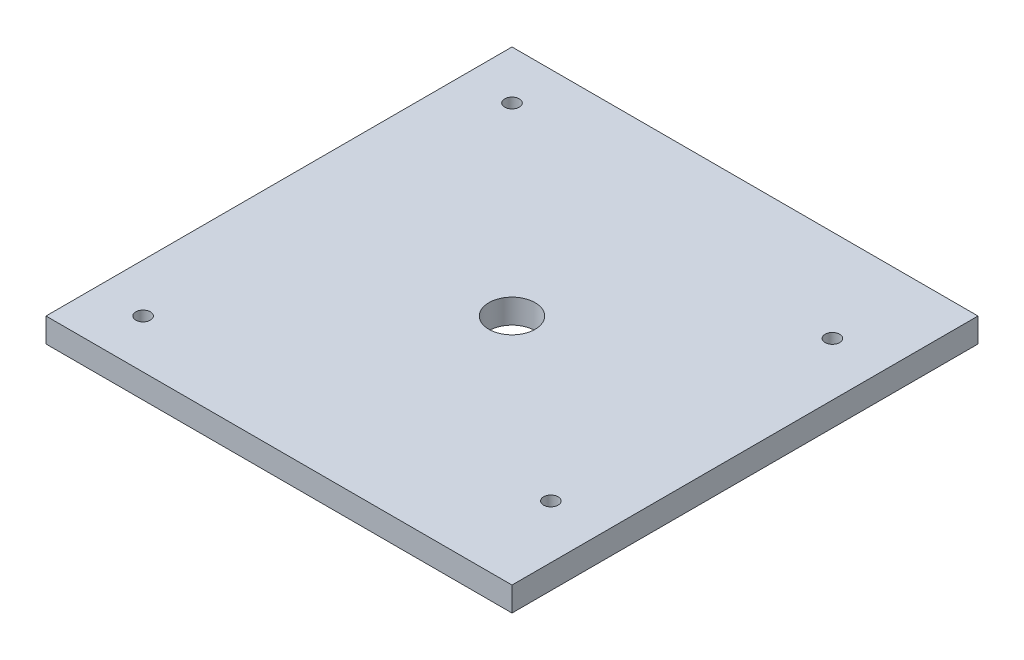
ISO-10303-21;
HEADER;
FILE_DESCRIPTION(('STEP AP214'),'2;1');
FILE_NAME('part.step','',(''),(''),'','','');
FILE_SCHEMA(('AUTOMOTIVE_DESIGN { 1 0 10303 214 1 1 1 1 }'));
ENDSEC;
DATA;
#1=APPLICATION_CONTEXT('core data for automotive mechanical design processes');
#2=APPLICATION_PROTOCOL_DEFINITION('international standard','automotive_design',2000,#1);
#3=PRODUCT_CONTEXT('',#1,'mechanical');
#4=PRODUCT('Part','Part','',(#3));
#5=PRODUCT_RELATED_PRODUCT_CATEGORY('part','',(#4));
#6=PRODUCT_DEFINITION_FORMATION('','',#4);
#7=PRODUCT_DEFINITION_CONTEXT('part definition',#1,'design');
#8=PRODUCT_DEFINITION('design','',#6,#7);
#9=PRODUCT_DEFINITION_SHAPE('','',#8);
#10=(LENGTH_UNIT() NAMED_UNIT(*) SI_UNIT(.MILLI.,.METRE.));
#11=(NAMED_UNIT(*) PLANE_ANGLE_UNIT() SI_UNIT($,.RADIAN.));
#12=(NAMED_UNIT(*) SI_UNIT($,.STERADIAN.) SOLID_ANGLE_UNIT());
#13=UNCERTAINTY_MEASURE_WITH_UNIT(LENGTH_MEASURE(1.E-05),#10,'distance_accuracy_value','');
#14=(GEOMETRIC_REPRESENTATION_CONTEXT(3) GLOBAL_UNCERTAINTY_ASSIGNED_CONTEXT((#13)) GLOBAL_UNIT_ASSIGNED_CONTEXT((#10,
#11,#12)) REPRESENTATION_CONTEXT('',''));
#15=CARTESIAN_POINT('',(0.,0.,0.));
#16=DIRECTION('',(0.,0.,1.));
#17=DIRECTION('',(1.,0.,0.));
#18=AXIS2_PLACEMENT_3D('',#15,#16,#17);
#19=CARTESIAN_POINT('',(0.,5.,0.));
#20=DIRECTION('',(0.,-1.,0.));
#21=DIRECTION('',(0.,0.,-1.));
#22=AXIS2_PLACEMENT_3D('',#19,#20,#21);
#23=PLANE('',#22);
#24=CARTESIAN_POINT('',(48.,5.,-48.));
#25=DIRECTION('',(0.,1.,0.));
#26=DIRECTION('',(0.,0.,1.));
#27=AXIS2_PLACEMENT_3D('',#24,#25,#26);
#28=CIRCLE('',#27,4.7625);
#29=CARTESIAN_POINT('',(48.,5.,-43.2375));
#30=VERTEX_POINT('',#29);
#31=EDGE_CURVE('E162',#30,#30,#28,.T.);
#32=ORIENTED_EDGE('',*,*,#31,.F.);
#33=EDGE_LOOP('',(#32));
#34=FACE_BOUND('',#33,.T.);
#35=DIRECTION('',(0.,0.,1.));
#36=VECTOR('',#35,1.);
#37=CARTESIAN_POINT('',(0.,5.,0.));
#38=LINE('',#37,#36);
#39=CARTESIAN_POINT('',(0.,5.,-96.));
#40=VERTEX_POINT('',#39);
#41=CARTESIAN_POINT('',(0.,5.,0.));
#42=VERTEX_POINT('',#41);
#43=EDGE_CURVE('E92',#40,#42,#38,.T.);
#44=ORIENTED_EDGE('',*,*,#43,.T.);
#45=DIRECTION('',(1.,0.,0.));
#46=VECTOR('',#45,1.);
#47=CARTESIAN_POINT('',(0.,5.,0.));
#48=LINE('',#47,#46);
#49=CARTESIAN_POINT('',(96.,5.,0.));
#50=VERTEX_POINT('',#49);
#51=EDGE_CURVE('E87',#42,#50,#48,.T.);
#52=ORIENTED_EDGE('',*,*,#51,.T.);
#53=DIRECTION('',(0.,0.,-1.));
#54=VECTOR('',#53,1.);
#55=CARTESIAN_POINT('',(96.,5.,0.));
#56=LINE('',#55,#54);
#57=CARTESIAN_POINT('',(96.,5.,-96.));
#58=VERTEX_POINT('',#57);
#59=EDGE_CURVE('E90',#50,#58,#56,.T.);
#60=ORIENTED_EDGE('',*,*,#59,.T.);
#61=DIRECTION('',(-1.,0.,0.));
#62=VECTOR('',#61,1.);
#63=CARTESIAN_POINT('',(0.,5.,-96.));
#64=LINE('',#63,#62);
#65=EDGE_CURVE('E57',#58,#40,#64,.T.);
#66=ORIENTED_EDGE('',*,*,#65,.T.);
#67=EDGE_LOOP('',(#44,#52,#60,#66));
#68=FACE_BOUND('',#67,.T.);
#69=CARTESIAN_POINT('',(10.,5.,-10.));
#70=DIRECTION('',(0.,1.,0.));
#71=DIRECTION('',(0.,0.,1.));
#72=AXIS2_PLACEMENT_3D('',#69,#70,#71);
#73=CIRCLE('',#72,1.5);
#74=CARTESIAN_POINT('',(10.,5.,-8.5));
#75=VERTEX_POINT('',#74);
#76=EDGE_CURVE('E112',#75,#75,#73,.T.);
#77=ORIENTED_EDGE('',*,*,#76,.F.);
#78=EDGE_LOOP('',(#77));
#79=FACE_BOUND('',#78,.T.);
#80=CARTESIAN_POINT('',(85.,5.,-19.));
#81=DIRECTION('',(0.,1.,0.));
#82=DIRECTION('',(0.,0.,1.));
#83=AXIS2_PLACEMENT_3D('',#80,#81,#82);
#84=CIRCLE('',#83,1.5);
#85=CARTESIAN_POINT('',(85.,5.,-17.5));
#86=VERTEX_POINT('',#85);
#87=EDGE_CURVE('E134',#86,#86,#84,.T.);
#88=ORIENTED_EDGE('',*,*,#87,.F.);
#89=EDGE_LOOP('',(#88));
#90=FACE_BOUND('',#89,.T.);
#91=CARTESIAN_POINT('',(85.,5.,-77.));
#92=DIRECTION('',(0.,1.,0.));
#93=DIRECTION('',(0.,0.,-1.));
#94=AXIS2_PLACEMENT_3D('',#91,#92,#93);
#95=CIRCLE('',#94,1.5);
#96=CARTESIAN_POINT('',(85.,5.,-78.5));
#97=VERTEX_POINT('',#96);
#98=EDGE_CURVE('E142',#97,#97,#95,.T.);
#99=ORIENTED_EDGE('',*,*,#98,.F.);
#100=EDGE_LOOP('',(#99));
#101=FACE_BOUND('',#100,.T.);
#102=CARTESIAN_POINT('',(10.,5.,-86.));
#103=DIRECTION('',(0.,1.,0.));
#104=DIRECTION('',(0.,0.,-1.));
#105=AXIS2_PLACEMENT_3D('',#102,#103,#104);
#106=CIRCLE('',#105,1.5);
#107=CARTESIAN_POINT('',(10.,5.,-87.5));
#108=VERTEX_POINT('',#107);
#109=EDGE_CURVE('E150',#108,#108,#106,.T.);
#110=ORIENTED_EDGE('',*,*,#109,.F.);
#111=EDGE_LOOP('',(#110));
#112=FACE_BOUND('',#111,.T.);
#113=ADVANCED_FACE('F39',(#34,#68,#79,#90,#101,#112),#23,.F.);
#114=CARTESIAN_POINT('',(0.,0.,0.));
#115=DIRECTION('',(0.,-1.,0.));
#116=DIRECTION('',(0.,0.,-1.));
#117=AXIS2_PLACEMENT_3D('',#114,#115,#116);
#118=PLANE('',#117);
#119=CARTESIAN_POINT('',(48.,0.,-48.));
#120=DIRECTION('',(0.,1.,0.));
#121=DIRECTION('',(0.,0.,1.));
#122=AXIS2_PLACEMENT_3D('',#119,#120,#121);
#123=CIRCLE('',#122,4.7625);
#124=CARTESIAN_POINT('',(48.,0.,-43.2375));
#125=VERTEX_POINT('',#124);
#126=EDGE_CURVE('E158',#125,#125,#123,.T.);
#127=ORIENTED_EDGE('',*,*,#126,.T.);
#128=EDGE_LOOP('',(#127));
#129=FACE_BOUND('',#128,.T.);
#130=CARTESIAN_POINT('',(85.,0.,-77.));
#131=DIRECTION('',(0.,1.,0.));
#132=DIRECTION('',(0.,0.,-1.));
#133=AXIS2_PLACEMENT_3D('',#130,#131,#132);
#134=CIRCLE('',#133,1.5);
#135=CARTESIAN_POINT('',(85.,0.,-78.5));
#136=VERTEX_POINT('',#135);
#137=EDGE_CURVE('E146',#136,#136,#134,.T.);
#138=ORIENTED_EDGE('',*,*,#137,.T.);
#139=EDGE_LOOP('',(#138));
#140=FACE_BOUND('',#139,.T.);
#141=CARTESIAN_POINT('',(10.,0.,-10.));
#142=DIRECTION('',(0.,1.,0.));
#143=DIRECTION('',(0.,0.,1.));
#144=AXIS2_PLACEMENT_3D('',#141,#142,#143);
#145=CIRCLE('',#144,1.5);
#146=CARTESIAN_POINT('',(10.,0.,-8.5));
#147=VERTEX_POINT('',#146);
#148=EDGE_CURVE('E130',#147,#147,#145,.T.);
#149=ORIENTED_EDGE('',*,*,#148,.T.);
#150=EDGE_LOOP('',(#149));
#151=FACE_BOUND('',#150,.T.);
#152=DIRECTION('',(0.,0.,1.));
#153=VECTOR('',#152,1.);
#154=CARTESIAN_POINT('',(0.,0.,0.));
#155=LINE('',#154,#153);
#156=CARTESIAN_POINT('',(0.,0.,-96.));
#157=VERTEX_POINT('',#156);
#158=CARTESIAN_POINT('',(0.,0.,0.));
#159=VERTEX_POINT('',#158);
#160=EDGE_CURVE('E108',#157,#159,#155,.T.);
#161=ORIENTED_EDGE('',*,*,#160,.F.);
#162=DIRECTION('',(-1.,0.,0.));
#163=VECTOR('',#162,1.);
#164=CARTESIAN_POINT('',(0.,0.,-96.));
#165=LINE('',#164,#163);
#166=CARTESIAN_POINT('',(96.,0.,-96.));
#167=VERTEX_POINT('',#166);
#168=EDGE_CURVE('E80',#167,#157,#165,.T.);
#169=ORIENTED_EDGE('',*,*,#168,.F.);
#170=DIRECTION('',(0.,0.,-1.));
#171=VECTOR('',#170,1.);
#172=CARTESIAN_POINT('',(96.,0.,0.));
#173=LINE('',#172,#171);
#174=CARTESIAN_POINT('',(96.,0.,0.));
#175=VERTEX_POINT('',#174);
#176=EDGE_CURVE('E74',#175,#167,#173,.T.);
#177=ORIENTED_EDGE('',*,*,#176,.F.);
#178=DIRECTION('',(1.,0.,0.));
#179=VECTOR('',#178,1.);
#180=CARTESIAN_POINT('',(0.,0.,0.));
#181=LINE('',#180,#179);
#182=EDGE_CURVE('E97',#159,#175,#181,.T.);
#183=ORIENTED_EDGE('',*,*,#182,.F.);
#184=EDGE_LOOP('',(#161,#169,#177,#183));
#185=FACE_BOUND('',#184,.T.);
#186=CARTESIAN_POINT('',(85.,0.,-19.));
#187=DIRECTION('',(0.,1.,0.));
#188=DIRECTION('',(0.,0.,1.));
#189=AXIS2_PLACEMENT_3D('',#186,#187,#188);
#190=CIRCLE('',#189,1.5);
#191=CARTESIAN_POINT('',(85.,0.,-17.5));
#192=VERTEX_POINT('',#191);
#193=EDGE_CURVE('E138',#192,#192,#190,.T.);
#194=ORIENTED_EDGE('',*,*,#193,.T.);
#195=EDGE_LOOP('',(#194));
#196=FACE_BOUND('',#195,.T.);
#197=CARTESIAN_POINT('',(10.,0.,-86.));
#198=DIRECTION('',(0.,1.,0.));
#199=DIRECTION('',(0.,0.,-1.));
#200=AXIS2_PLACEMENT_3D('',#197,#198,#199);
#201=CIRCLE('',#200,1.5);
#202=CARTESIAN_POINT('',(10.,0.,-87.5));
#203=VERTEX_POINT('',#202);
#204=EDGE_CURVE('E154',#203,#203,#201,.T.);
#205=ORIENTED_EDGE('',*,*,#204,.T.);
#206=EDGE_LOOP('',(#205));
#207=FACE_BOUND('',#206,.T.);
#208=ADVANCED_FACE('F125',(#129,#140,#151,#185,#196,#207),#118,.T.);
#209=CARTESIAN_POINT('',(0.,5.,0.));
#210=DIRECTION('',(1.,0.,0.));
#211=DIRECTION('',(0.,0.,-1.));
#212=AXIS2_PLACEMENT_3D('',#209,#210,#211);
#213=PLANE('',#212);
#214=ORIENTED_EDGE('',*,*,#160,.T.);
#215=DIRECTION('',(0.,-1.,0.));
#216=VECTOR('',#215,1.);
#217=CARTESIAN_POINT('',(0.,5.,0.));
#218=LINE('',#217,#216);
#219=EDGE_CURVE('E11',#42,#159,#218,.T.);
#220=ORIENTED_EDGE('',*,*,#219,.F.);
#221=ORIENTED_EDGE('',*,*,#43,.F.);
#222=DIRECTION('',(0.,-1.,0.));
#223=VECTOR('',#222,1.);
#224=CARTESIAN_POINT('',(0.,5.,-96.));
#225=LINE('',#224,#223);
#226=EDGE_CURVE('E104',#40,#157,#225,.T.);
#227=ORIENTED_EDGE('',*,*,#226,.T.);
#228=EDGE_LOOP('',(#214,#220,#221,#227));
#229=FACE_BOUND('',#228,.T.);
#230=ADVANCED_FACE('F41',(#229),#213,.F.);
#231=CARTESIAN_POINT('',(0.,5.,0.));
#232=DIRECTION('',(0.,0.,-1.));
#233=DIRECTION('',(-1.,0.,0.));
#234=AXIS2_PLACEMENT_3D('',#231,#232,#233);
#235=PLANE('',#234);
#236=ORIENTED_EDGE('',*,*,#182,.T.);
#237=DIRECTION('',(0.,-1.,0.));
#238=VECTOR('',#237,1.);
#239=CARTESIAN_POINT('',(96.,5.,0.));
#240=LINE('',#239,#238);
#241=EDGE_CURVE('E49',#50,#175,#240,.T.);
#242=ORIENTED_EDGE('',*,*,#241,.F.);
#243=ORIENTED_EDGE('',*,*,#51,.F.);
#244=ORIENTED_EDGE('',*,*,#219,.T.);
#245=EDGE_LOOP('',(#236,#242,#243,#244));
#246=FACE_BOUND('',#245,.T.);
#247=ADVANCED_FACE('F96',(#246),#235,.F.);
#248=CARTESIAN_POINT('',(96.,5.,0.));
#249=DIRECTION('',(-1.,0.,0.));
#250=DIRECTION('',(0.,0.,1.));
#251=AXIS2_PLACEMENT_3D('',#248,#249,#250);
#252=PLANE('',#251);
#253=ORIENTED_EDGE('',*,*,#176,.T.);
#254=DIRECTION('',(0.,-1.,0.));
#255=VECTOR('',#254,1.);
#256=CARTESIAN_POINT('',(96.,5.,-96.));
#257=LINE('',#256,#255);
#258=EDGE_CURVE('E99',#58,#167,#257,.T.);
#259=ORIENTED_EDGE('',*,*,#258,.F.);
#260=ORIENTED_EDGE('',*,*,#59,.F.);
#261=ORIENTED_EDGE('',*,*,#241,.T.);
#262=EDGE_LOOP('',(#253,#259,#260,#261));
#263=FACE_BOUND('',#262,.T.);
#264=ADVANCED_FACE('F100',(#263),#252,.F.);
#265=CARTESIAN_POINT('',(0.,5.,-96.));
#266=DIRECTION('',(0.,0.,1.));
#267=DIRECTION('',(1.,0.,0.));
#268=AXIS2_PLACEMENT_3D('',#265,#266,#267);
#269=PLANE('',#268);
#270=ORIENTED_EDGE('',*,*,#168,.T.);
#271=ORIENTED_EDGE('',*,*,#226,.F.);
#272=ORIENTED_EDGE('',*,*,#65,.F.);
#273=ORIENTED_EDGE('',*,*,#258,.T.);
#274=EDGE_LOOP('',(#270,#271,#272,#273));
#275=FACE_BOUND('',#274,.T.);
#276=ADVANCED_FACE('F122',(#275),#269,.F.);
#277=CARTESIAN_POINT('',(10.,5.,-10.));
#278=DIRECTION('',(0.,-1.,0.));
#279=DIRECTION('',(0.,0.,-1.));
#280=AXIS2_PLACEMENT_3D('',#277,#278,#279);
#281=CYLINDRICAL_SURFACE('',#280,1.5);
#282=ORIENTED_EDGE('',*,*,#76,.T.);
#283=EDGE_LOOP('',(#282));
#284=FACE_BOUND('',#283,.T.);
#285=ORIENTED_EDGE('',*,*,#148,.F.);
#286=EDGE_LOOP('',(#285));
#287=FACE_BOUND('',#286,.T.);
#288=ADVANCED_FACE('F186',(#284,#287),#281,.F.);
#289=CARTESIAN_POINT('',(85.,5.,-19.));
#290=DIRECTION('',(0.,-1.,0.));
#291=DIRECTION('',(0.,0.,-1.));
#292=AXIS2_PLACEMENT_3D('',#289,#290,#291);
#293=CYLINDRICAL_SURFACE('',#292,1.5);
#294=ORIENTED_EDGE('',*,*,#87,.T.);
#295=EDGE_LOOP('',(#294));
#296=FACE_BOUND('',#295,.T.);
#297=ORIENTED_EDGE('',*,*,#193,.F.);
#298=EDGE_LOOP('',(#297));
#299=FACE_BOUND('',#298,.T.);
#300=ADVANCED_FACE('F226',(#296,#299),#293,.F.);
#301=CARTESIAN_POINT('',(85.,5.,-77.));
#302=DIRECTION('',(0.,-1.,0.));
#303=DIRECTION('',(0.,0.,-1.));
#304=AXIS2_PLACEMENT_3D('',#301,#302,#303);
#305=CYLINDRICAL_SURFACE('',#304,1.5);
#306=ORIENTED_EDGE('',*,*,#98,.T.);
#307=EDGE_LOOP('',(#306));
#308=FACE_BOUND('',#307,.T.);
#309=ORIENTED_EDGE('',*,*,#137,.F.);
#310=EDGE_LOOP('',(#309));
#311=FACE_BOUND('',#310,.T.);
#312=ADVANCED_FACE('F219',(#308,#311),#305,.F.);
#313=CARTESIAN_POINT('',(10.,5.,-86.));
#314=DIRECTION('',(0.,-1.,0.));
#315=DIRECTION('',(0.,0.,-1.));
#316=AXIS2_PLACEMENT_3D('',#313,#314,#315);
#317=CYLINDRICAL_SURFACE('',#316,1.5);
#318=ORIENTED_EDGE('',*,*,#109,.T.);
#319=EDGE_LOOP('',(#318));
#320=FACE_BOUND('',#319,.T.);
#321=ORIENTED_EDGE('',*,*,#204,.F.);
#322=EDGE_LOOP('',(#321));
#323=FACE_BOUND('',#322,.T.);
#324=ADVANCED_FACE('F175',(#320,#323),#317,.F.);
#325=CARTESIAN_POINT('',(48.,0.,-48.));
#326=DIRECTION('',(0.,1.,0.));
#327=DIRECTION('',(0.,0.,1.));
#328=AXIS2_PLACEMENT_3D('',#325,#326,#327);
#329=CYLINDRICAL_SURFACE('',#328,4.7625);
#330=ORIENTED_EDGE('',*,*,#126,.F.);
#331=EDGE_LOOP('',(#330));
#332=FACE_BOUND('',#331,.T.);
#333=ORIENTED_EDGE('',*,*,#31,.T.);
#334=EDGE_LOOP('',(#333));
#335=FACE_BOUND('',#334,.T.);
#336=ADVANCED_FACE('F172',(#332,#335),#329,.F.);
#337=CLOSED_SHELL('',(#113,#208,#230,#247,#264,#276,#288,#300,#312,#324,#336));
#338=MANIFOLD_SOLID_BREP('B2',#337);
#339=ADVANCED_BREP_SHAPE_REPRESENTATION('',(#18,#338),#14);
#340=SHAPE_DEFINITION_REPRESENTATION(#9,#339);
ENDSEC;
END-ISO-10303-21;
